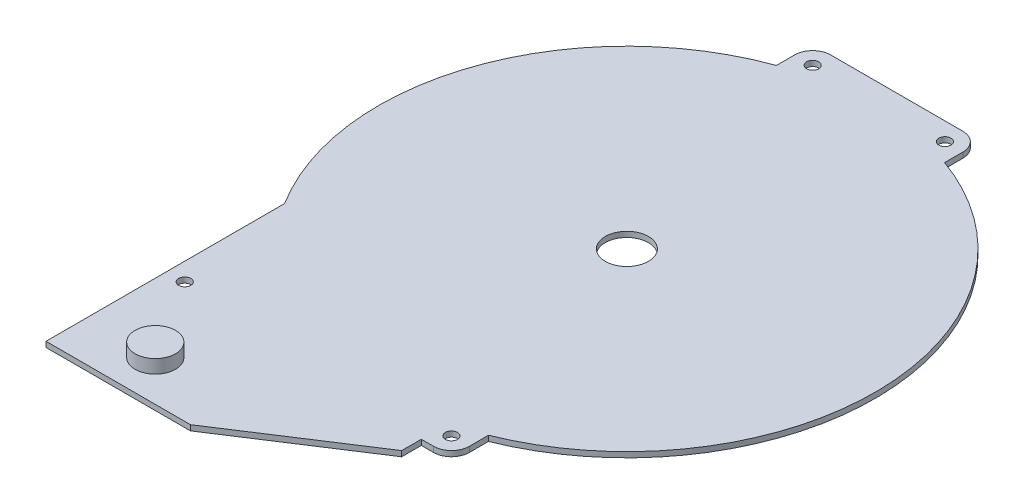
ISO-10303-21;
HEADER;
FILE_DESCRIPTION(('STEP AP214'),'2;1');
FILE_NAME('part.step','',(''),(''),'','','');
FILE_SCHEMA(('AUTOMOTIVE_DESIGN { 1 0 10303 214 1 1 1 1 }'));
ENDSEC;
DATA;
#1=APPLICATION_CONTEXT('core data for automotive mechanical design processes');
#2=APPLICATION_PROTOCOL_DEFINITION('international standard','automotive_design',2000,#1);
#3=PRODUCT_CONTEXT('',#1,'mechanical');
#4=PRODUCT('Part','Part','',(#3));
#5=PRODUCT_RELATED_PRODUCT_CATEGORY('part','',(#4));
#6=PRODUCT_DEFINITION_FORMATION('','',#4);
#7=PRODUCT_DEFINITION_CONTEXT('part definition',#1,'design');
#8=PRODUCT_DEFINITION('design','',#6,#7);
#9=PRODUCT_DEFINITION_SHAPE('','',#8);
#10=(LENGTH_UNIT() NAMED_UNIT(*) SI_UNIT(.MILLI.,.METRE.));
#11=(NAMED_UNIT(*) PLANE_ANGLE_UNIT() SI_UNIT($,.RADIAN.));
#12=(NAMED_UNIT(*) SI_UNIT($,.STERADIAN.) SOLID_ANGLE_UNIT());
#13=UNCERTAINTY_MEASURE_WITH_UNIT(LENGTH_MEASURE(1.E-05),#10,'distance_accuracy_value','');
#14=(GEOMETRIC_REPRESENTATION_CONTEXT(3) GLOBAL_UNCERTAINTY_ASSIGNED_CONTEXT((#13)) GLOBAL_UNIT_ASSIGNED_CONTEXT((#10,
#11,#12)) REPRESENTATION_CONTEXT('',''));
#15=CARTESIAN_POINT('',(0.,0.,0.));
#16=DIRECTION('',(0.,0.,1.));
#17=DIRECTION('',(1.,0.,0.));
#18=AXIS2_PLACEMENT_3D('',#15,#16,#17);
#19=CARTESIAN_POINT('',(0.,-13.5,0.));
#20=DIRECTION('',(0.,-1.,0.));
#21=DIRECTION('',(1.,0.,0.));
#22=AXIS2_PLACEMENT_3D('',#19,#20,#21);
#23=CYLINDRICAL_SURFACE('',#22,92.);
#24=CARTESIAN_POINT('',(0.,-15.5,0.));
#25=DIRECTION('',(0.,-1.,0.));
#26=DIRECTION('',(1.,0.,0.));
#27=AXIS2_PLACEMENT_3D('',#24,#25,#26);
#28=CIRCLE('',#27,92.);
#29=CARTESIAN_POINT('',(31.1619048833757,-15.5,-86.5617449225664));
#30=VERTEX_POINT('',#29);
#31=CARTESIAN_POINT('',(34.15,-15.5,85.4270302656015));
#32=VERTEX_POINT('',#31);
#33=EDGE_CURVE('E170',#30,#32,#28,.T.);
#34=ORIENTED_EDGE('',*,*,#33,.F.);
#35=DIRECTION('',(0.,-1.,0.));
#36=VECTOR('',#35,1.);
#37=CARTESIAN_POINT('',(31.1619048833757,-13.5,-86.5617449225664));
#38=LINE('',#37,#36);
#39=CARTESIAN_POINT('',(31.1619048833757,-13.5,-86.5617449225664));
#40=VERTEX_POINT('',#39);
#41=EDGE_CURVE('E44',#40,#30,#38,.T.);
#42=ORIENTED_EDGE('',*,*,#41,.F.);
#43=CARTESIAN_POINT('',(0.,-13.5,0.));
#44=DIRECTION('',(0.,-1.,0.));
#45=DIRECTION('',(1.,0.,0.));
#46=AXIS2_PLACEMENT_3D('',#43,#44,#45);
#47=CIRCLE('',#46,92.);
#48=CARTESIAN_POINT('',(34.15,-13.5,85.4270302656015));
#49=VERTEX_POINT('',#48);
#50=EDGE_CURVE('E210',#40,#49,#47,.T.);
#51=ORIENTED_EDGE('',*,*,#50,.T.);
#52=DIRECTION('',(0.,-1.,0.));
#53=VECTOR('',#52,1.);
#54=CARTESIAN_POINT('',(34.15,-13.5,85.4270302656015));
#55=LINE('',#54,#53);
#56=EDGE_CURVE('E110',#49,#32,#55,.T.);
#57=ORIENTED_EDGE('',*,*,#56,.T.);
#58=EDGE_LOOP('',(#34,#42,#51,#57));
#59=FACE_BOUND('',#58,.T.);
#60=ADVANCED_FACE('F35',(#59),#23,.T.);
#61=CARTESIAN_POINT('',(31.1619048833757,-13.5,-93.3380951166243));
#62=DIRECTION('',(1.,0.,0.));
#63=DIRECTION('',(0.,1.,0.));
#64=AXIS2_PLACEMENT_3D('',#61,#62,#63);
#65=PLANE('',#64);
#66=DIRECTION('',(0.,0.,1.));
#67=VECTOR('',#66,1.);
#68=CARTESIAN_POINT('',(31.1619048833757,-15.5,-93.3380951166243));
#69=LINE('',#68,#67);
#70=CARTESIAN_POINT('',(31.1619048833757,-15.5,-93.3380951166243));
#71=VERTEX_POINT('',#70);
#72=EDGE_CURVE('E207',#71,#30,#69,.T.);
#73=ORIENTED_EDGE('',*,*,#72,.F.);
#74=DIRECTION('',(0.,-1.,0.));
#75=VECTOR('',#74,1.);
#76=CARTESIAN_POINT('',(31.1619048833757,-13.5,-93.3380951166243));
#77=LINE('',#76,#75);
#78=CARTESIAN_POINT('',(31.1619048833757,-13.5,-93.3380951166243));
#79=VERTEX_POINT('',#78);
#80=EDGE_CURVE('E98',#79,#71,#77,.T.);
#81=ORIENTED_EDGE('',*,*,#80,.F.);
#82=DIRECTION('',(0.,0.,1.));
#83=VECTOR('',#82,1.);
#84=CARTESIAN_POINT('',(31.1619048833757,-13.5,-93.3380951166243));
#85=LINE('',#84,#83);
#86=EDGE_CURVE('E160',#79,#40,#85,.T.);
#87=ORIENTED_EDGE('',*,*,#86,.T.);
#88=ORIENTED_EDGE('',*,*,#41,.T.);
#89=EDGE_LOOP('',(#73,#81,#87,#88));
#90=FACE_BOUND('',#89,.T.);
#91=ADVANCED_FACE('F236',(#90),#65,.T.);
#92=CARTESIAN_POINT('',(24.5,-13.5,-93.3380951166243));
#93=DIRECTION('',(0.,-1.,0.));
#94=DIRECTION('',(1.,0.,0.));
#95=AXIS2_PLACEMENT_3D('',#92,#93,#94);
#96=CYLINDRICAL_SURFACE('',#95,6.6619048833757);
#97=CARTESIAN_POINT('',(24.5,-15.5,-93.3380951166243));
#98=DIRECTION('',(0.,-1.,0.));
#99=DIRECTION('',(1.,0.,0.));
#100=AXIS2_PLACEMENT_3D('',#97,#98,#99);
#101=CIRCLE('',#100,6.6619048833757);
#102=CARTESIAN_POINT('',(24.5,-15.5,-100.));
#103=VERTEX_POINT('',#102);
#104=EDGE_CURVE('E147',#103,#71,#101,.T.);
#105=ORIENTED_EDGE('',*,*,#104,.F.);
#106=DIRECTION('',(0.,-1.,0.));
#107=VECTOR('',#106,1.);
#108=CARTESIAN_POINT('',(24.5,-13.5,-100.));
#109=LINE('',#108,#107);
#110=CARTESIAN_POINT('',(24.5,-13.5,-100.));
#111=VERTEX_POINT('',#110);
#112=EDGE_CURVE('E142',#111,#103,#109,.T.);
#113=ORIENTED_EDGE('',*,*,#112,.F.);
#114=CARTESIAN_POINT('',(24.5,-13.5,-93.3380951166243));
#115=DIRECTION('',(0.,-1.,0.));
#116=DIRECTION('',(1.,0.,0.));
#117=AXIS2_PLACEMENT_3D('',#114,#115,#116);
#118=CIRCLE('',#117,6.6619048833757);
#119=EDGE_CURVE('E145',#111,#79,#118,.T.);
#120=ORIENTED_EDGE('',*,*,#119,.T.);
#121=ORIENTED_EDGE('',*,*,#80,.T.);
#122=EDGE_LOOP('',(#105,#113,#120,#121));
#123=FACE_BOUND('',#122,.T.);
#124=ADVANCED_FACE('F144',(#123),#96,.T.);
#125=CARTESIAN_POINT('',(-24.5,-13.5,-100.));
#126=DIRECTION('',(0.,0.,-1.));
#127=DIRECTION('',(-1.,0.,0.));
#128=AXIS2_PLACEMENT_3D('',#125,#126,#127);
#129=PLANE('',#128);
#130=DIRECTION('',(1.,0.,0.));
#131=VECTOR('',#130,1.);
#132=CARTESIAN_POINT('',(-24.5,-15.5,-100.));
#133=LINE('',#132,#131);
#134=CARTESIAN_POINT('',(-24.5,-15.5,-100.));
#135=VERTEX_POINT('',#134);
#136=EDGE_CURVE('E204',#135,#103,#133,.T.);
#137=ORIENTED_EDGE('',*,*,#136,.F.);
#138=DIRECTION('',(0.,-1.,0.));
#139=VECTOR('',#138,1.);
#140=CARTESIAN_POINT('',(-24.5,-13.5,-100.));
#141=LINE('',#140,#139);
#142=CARTESIAN_POINT('',(-24.5,-13.5,-100.));
#143=VERTEX_POINT('',#142);
#144=EDGE_CURVE('E152',#143,#135,#141,.T.);
#145=ORIENTED_EDGE('',*,*,#144,.F.);
#146=DIRECTION('',(1.,0.,0.));
#147=VECTOR('',#146,1.);
#148=CARTESIAN_POINT('',(-24.5,-13.5,-100.));
#149=LINE('',#148,#147);
#150=EDGE_CURVE('E158',#143,#111,#149,.T.);
#151=ORIENTED_EDGE('',*,*,#150,.T.);
#152=ORIENTED_EDGE('',*,*,#112,.T.);
#153=EDGE_LOOP('',(#137,#145,#151,#152));
#154=FACE_BOUND('',#153,.T.);
#155=ADVANCED_FACE('F162',(#154),#129,.T.);
#156=CARTESIAN_POINT('',(-24.5,-13.5,-93.3380951166243));
#157=DIRECTION('',(0.,-1.,0.));
#158=DIRECTION('',(1.,0.,0.));
#159=AXIS2_PLACEMENT_3D('',#156,#157,#158);
#160=CYLINDRICAL_SURFACE('',#159,6.6619048833757);
#161=CARTESIAN_POINT('',(-24.5,-15.5,-93.3380951166243));
#162=DIRECTION('',(0.,-1.,0.));
#163=DIRECTION('',(1.,0.,0.));
#164=AXIS2_PLACEMENT_3D('',#161,#162,#163);
#165=CIRCLE('',#164,6.6619048833757);
#166=CARTESIAN_POINT('',(-31.1619048833757,-15.5,-93.3380951166243));
#167=VERTEX_POINT('',#166);
#168=EDGE_CURVE('E201',#167,#135,#165,.T.);
#169=ORIENTED_EDGE('',*,*,#168,.F.);
#170=DIRECTION('',(0.,-1.,0.));
#171=VECTOR('',#170,1.);
#172=CARTESIAN_POINT('',(-31.1619048833757,-13.5,-93.3380951166243));
#173=LINE('',#172,#171);
#174=CARTESIAN_POINT('',(-31.1619048833757,-13.5,-93.3380951166243));
#175=VERTEX_POINT('',#174);
#176=EDGE_CURVE('E214',#175,#167,#173,.T.);
#177=ORIENTED_EDGE('',*,*,#176,.F.);
#178=CARTESIAN_POINT('',(-24.5,-13.5,-93.3380951166243));
#179=DIRECTION('',(0.,-1.,0.));
#180=DIRECTION('',(1.,0.,0.));
#181=AXIS2_PLACEMENT_3D('',#178,#179,#180);
#182=CIRCLE('',#181,6.6619048833757);
#183=EDGE_CURVE('E163',#175,#143,#182,.T.);
#184=ORIENTED_EDGE('',*,*,#183,.T.);
#185=ORIENTED_EDGE('',*,*,#144,.T.);
#186=EDGE_LOOP('',(#169,#177,#184,#185));
#187=FACE_BOUND('',#186,.T.);
#188=ADVANCED_FACE('F249',(#187),#160,.T.);
#189=CARTESIAN_POINT('',(-31.1619048833757,-13.5,-86.5617449225664));
#190=DIRECTION('',(-1.,0.,0.));
#191=DIRECTION('',(0.,0.,1.));
#192=AXIS2_PLACEMENT_3D('',#189,#190,#191);
#193=PLANE('',#192);
#194=DIRECTION('',(0.,0.,-1.));
#195=VECTOR('',#194,1.);
#196=CARTESIAN_POINT('',(-31.1619048833757,-15.5,-86.5617449225664));
#197=LINE('',#196,#195);
#198=CARTESIAN_POINT('',(-31.1619048833757,-15.5,-86.5617449225664));
#199=VERTEX_POINT('',#198);
#200=EDGE_CURVE('E198',#199,#167,#197,.T.);
#201=ORIENTED_EDGE('',*,*,#200,.F.);
#202=DIRECTION('',(0.,-1.,0.));
#203=VECTOR('',#202,1.);
#204=CARTESIAN_POINT('',(-31.1619048833757,-13.5,-86.5617449225664));
#205=LINE('',#204,#203);
#206=CARTESIAN_POINT('',(-31.1619048833757,-13.5,-86.5617449225664));
#207=VERTEX_POINT('',#206);
#208=EDGE_CURVE('E216',#207,#199,#205,.T.);
#209=ORIENTED_EDGE('',*,*,#208,.F.);
#210=DIRECTION('',(0.,0.,-1.));
#211=VECTOR('',#210,1.);
#212=CARTESIAN_POINT('',(-31.1619048833757,-13.5,-86.5617449225664));
#213=LINE('',#212,#211);
#214=EDGE_CURVE('E165',#207,#175,#213,.T.);
#215=ORIENTED_EDGE('',*,*,#214,.T.);
#216=ORIENTED_EDGE('',*,*,#176,.T.);
#217=EDGE_LOOP('',(#201,#209,#215,#216));
#218=FACE_BOUND('',#217,.T.);
#219=ADVANCED_FACE('F252',(#218),#193,.T.);
#220=CARTESIAN_POINT('',(0.,-13.5,0.));
#221=DIRECTION('',(0.,-1.,0.));
#222=DIRECTION('',(1.,0.,0.));
#223=AXIS2_PLACEMENT_3D('',#220,#221,#222);
#224=CYLINDRICAL_SURFACE('',#223,92.);
#225=CARTESIAN_POINT('',(0.,-15.5,0.));
#226=DIRECTION('',(0.,-1.,0.));
#227=DIRECTION('',(1.,0.,0.));
#228=AXIS2_PLACEMENT_3D('',#225,#226,#227);
#229=CIRCLE('',#228,92.);
#230=CARTESIAN_POINT('',(-77.9665998412951,-15.5,48.8386047014794));
#231=VERTEX_POINT('',#230);
#232=EDGE_CURVE('E195',#231,#199,#229,.T.);
#233=ORIENTED_EDGE('',*,*,#232,.F.);
#234=DIRECTION('',(0.,-1.,0.));
#235=VECTOR('',#234,1.);
#236=CARTESIAN_POINT('',(-77.9665998412951,-13.5,48.8386047014794));
#237=LINE('',#236,#235);
#238=CARTESIAN_POINT('',(-77.9665998412951,-13.5,48.8386047014794));
#239=VERTEX_POINT('',#238);
#240=EDGE_CURVE('E218',#239,#231,#237,.T.);
#241=ORIENTED_EDGE('',*,*,#240,.F.);
#242=CARTESIAN_POINT('',(0.,-13.5,0.));
#243=DIRECTION('',(0.,-1.,0.));
#244=DIRECTION('',(1.,0.,0.));
#245=AXIS2_PLACEMENT_3D('',#242,#243,#244);
#246=CIRCLE('',#245,92.);
#247=EDGE_CURVE('E379',#239,#207,#246,.T.);
#248=ORIENTED_EDGE('',*,*,#247,.T.);
#249=ORIENTED_EDGE('',*,*,#208,.T.);
#250=EDGE_LOOP('',(#233,#241,#248,#249));
#251=FACE_BOUND('',#250,.T.);
#252=ADVANCED_FACE('F256',(#251),#224,.T.);
#253=CARTESIAN_POINT('',(-77.9665998412951,-13.5,137.248466625773));
#254=DIRECTION('',(-1.,0.,0.));
#255=DIRECTION('',(0.,0.,1.));
#256=AXIS2_PLACEMENT_3D('',#253,#254,#255);
#257=PLANE('',#256);
#258=DIRECTION('',(0.,0.,-1.));
#259=VECTOR('',#258,1.);
#260=CARTESIAN_POINT('',(-77.9665998412951,-15.5,137.248466625773));
#261=LINE('',#260,#259);
#262=CARTESIAN_POINT('',(-77.9665998412951,-15.5,137.248466625773));
#263=VERTEX_POINT('',#262);
#264=EDGE_CURVE('E192',#263,#231,#261,.T.);
#265=ORIENTED_EDGE('',*,*,#264,.F.);
#266=DIRECTION('',(0.,-1.,0.));
#267=VECTOR('',#266,1.);
#268=CARTESIAN_POINT('',(-77.9665998412951,-13.5,137.248466625773));
#269=LINE('',#268,#267);
#270=CARTESIAN_POINT('',(-77.9665998412951,-13.5,137.248466625773));
#271=VERTEX_POINT('',#270);
#272=EDGE_CURVE('E220',#271,#263,#269,.T.);
#273=ORIENTED_EDGE('',*,*,#272,.F.);
#274=DIRECTION('',(0.,0.,-1.));
#275=VECTOR('',#274,1.);
#276=CARTESIAN_POINT('',(-77.9665998412951,-13.5,137.248466625773));
#277=LINE('',#276,#275);
#278=EDGE_CURVE('E376',#271,#239,#277,.T.);
#279=ORIENTED_EDGE('',*,*,#278,.T.);
#280=ORIENTED_EDGE('',*,*,#240,.T.);
#281=EDGE_LOOP('',(#265,#273,#279,#280));
#282=FACE_BOUND('',#281,.T.);
#283=ADVANCED_FACE('F260',(#282),#257,.T.);
#284=CARTESIAN_POINT('',(-24.4583644649651,-13.5,137.248466625773));
#285=DIRECTION('',(0.,0.,1.));
#286=DIRECTION('',(1.,0.,0.));
#287=AXIS2_PLACEMENT_3D('',#284,#285,#286);
#288=PLANE('',#287);
#289=DIRECTION('',(-1.,0.,0.));
#290=VECTOR('',#289,1.);
#291=CARTESIAN_POINT('',(-24.4583644649651,-15.5,137.248466625773));
#292=LINE('',#291,#290);
#293=CARTESIAN_POINT('',(-24.4583644649651,-15.5,137.248466625773));
#294=VERTEX_POINT('',#293);
#295=EDGE_CURVE('E189',#294,#263,#292,.T.);
#296=ORIENTED_EDGE('',*,*,#295,.F.);
#297=DIRECTION('',(0.,-1.,0.));
#298=VECTOR('',#297,1.);
#299=CARTESIAN_POINT('',(-24.4583644649651,-13.5,137.248466625773));
#300=LINE('',#299,#298);
#301=CARTESIAN_POINT('',(-24.4583644649651,-13.5,137.248466625773));
#302=VERTEX_POINT('',#301);
#303=EDGE_CURVE('E222',#302,#294,#300,.T.);
#304=ORIENTED_EDGE('',*,*,#303,.F.);
#305=DIRECTION('',(-1.,0.,0.));
#306=VECTOR('',#305,1.);
#307=CARTESIAN_POINT('',(-24.4583644649651,-13.5,137.248466625773));
#308=LINE('',#307,#306);
#309=EDGE_CURVE('E373',#302,#271,#308,.T.);
#310=ORIENTED_EDGE('',*,*,#309,.T.);
#311=ORIENTED_EDGE('',*,*,#272,.T.);
#312=EDGE_LOOP('',(#296,#304,#310,#311));
#313=FACE_BOUND('',#312,.T.);
#314=ADVANCED_FACE('F264',(#313),#288,.T.);
#315=CARTESIAN_POINT('',(23.,-13.5,106.42864438149));
#316=DIRECTION('',(0.544639035015023,0.,0.838670567945427));
#317=DIRECTION('',(0.838670567945427,0.,-0.544639035015023));
#318=AXIS2_PLACEMENT_3D('',#315,#316,#317);
#319=PLANE('',#318);
#320=DIRECTION('',(-0.838670567945427,0.,0.544639035015023));
#321=VECTOR('',#320,1.);
#322=CARTESIAN_POINT('',(23.,-15.5,106.42864438149));
#323=LINE('',#322,#321);
#324=CARTESIAN_POINT('',(23.,-15.5,106.42864438149));
#325=VERTEX_POINT('',#324);
#326=EDGE_CURVE('E186',#325,#294,#323,.T.);
#327=ORIENTED_EDGE('',*,*,#326,.F.);
#328=DIRECTION('',(0.,-1.,0.));
#329=VECTOR('',#328,1.);
#330=CARTESIAN_POINT('',(23.,-13.5,106.42864438149));
#331=LINE('',#330,#329);
#332=CARTESIAN_POINT('',(23.,-13.5,106.42864438149));
#333=VERTEX_POINT('',#332);
#334=EDGE_CURVE('E224',#333,#325,#331,.T.);
#335=ORIENTED_EDGE('',*,*,#334,.F.);
#336=DIRECTION('',(-0.838670567945427,0.,0.544639035015023));
#337=VECTOR('',#336,1.);
#338=CARTESIAN_POINT('',(23.,-13.5,106.42864438149));
#339=LINE('',#338,#337);
#340=EDGE_CURVE('E370',#333,#302,#339,.T.);
#341=ORIENTED_EDGE('',*,*,#340,.T.);
#342=ORIENTED_EDGE('',*,*,#303,.T.);
#343=EDGE_LOOP('',(#327,#335,#341,#342));
#344=FACE_BOUND('',#343,.T.);
#345=ADVANCED_FACE('F268',(#344),#319,.T.);
#346=CARTESIAN_POINT('',(23.,-13.5,99.1486486387774));
#347=DIRECTION('',(1.,0.,0.));
#348=DIRECTION('',(0.,0.,-1.));
#349=AXIS2_PLACEMENT_3D('',#346,#347,#348);
#350=PLANE('',#349);
#351=DIRECTION('',(0.,0.,1.));
#352=VECTOR('',#351,1.);
#353=CARTESIAN_POINT('',(23.,-15.5,99.1486486387774));
#354=LINE('',#353,#352);
#355=CARTESIAN_POINT('',(23.,-15.5,99.1486486387774));
#356=VERTEX_POINT('',#355);
#357=EDGE_CURVE('E183',#356,#325,#354,.T.);
#358=ORIENTED_EDGE('',*,*,#357,.F.);
#359=DIRECTION('',(0.,-1.,0.));
#360=VECTOR('',#359,1.);
#361=CARTESIAN_POINT('',(23.,-13.5,99.1486486387774));
#362=LINE('',#361,#360);
#363=CARTESIAN_POINT('',(23.,-13.5,99.1486486387774));
#364=VERTEX_POINT('',#363);
#365=EDGE_CURVE('E226',#364,#356,#362,.T.);
#366=ORIENTED_EDGE('',*,*,#365,.F.);
#367=DIRECTION('',(0.,0.,1.));
#368=VECTOR('',#367,1.);
#369=CARTESIAN_POINT('',(23.,-13.5,99.1486486387774));
#370=LINE('',#369,#368);
#371=EDGE_CURVE('E367',#364,#333,#370,.T.);
#372=ORIENTED_EDGE('',*,*,#371,.T.);
#373=ORIENTED_EDGE('',*,*,#334,.T.);
#374=EDGE_LOOP('',(#358,#366,#372,#373));
#375=FACE_BOUND('',#374,.T.);
#376=ADVANCED_FACE('F272',(#375),#350,.T.);
#377=CARTESIAN_POINT('',(27.5,-13.5,99.1486486387774));
#378=DIRECTION('',(0.,0.,1.));
#379=DIRECTION('',(1.,0.,0.));
#380=AXIS2_PLACEMENT_3D('',#377,#378,#379);
#381=PLANE('',#380);
#382=DIRECTION('',(-1.,0.,0.));
#383=VECTOR('',#382,1.);
#384=CARTESIAN_POINT('',(27.5,-15.5,99.1486486387774));
#385=LINE('',#384,#383);
#386=CARTESIAN_POINT('',(27.5,-15.5,99.1486486387774));
#387=VERTEX_POINT('',#386);
#388=EDGE_CURVE('E180',#387,#356,#385,.T.);
#389=ORIENTED_EDGE('',*,*,#388,.F.);
#390=DIRECTION('',(0.,-1.,0.));
#391=VECTOR('',#390,1.);
#392=CARTESIAN_POINT('',(27.5,-13.5,99.1486486387774));
#393=LINE('',#392,#391);
#394=CARTESIAN_POINT('',(27.5,-13.5,99.1486486387774));
#395=VERTEX_POINT('',#394);
#396=EDGE_CURVE('E228',#395,#387,#393,.T.);
#397=ORIENTED_EDGE('',*,*,#396,.F.);
#398=DIRECTION('',(-1.,0.,0.));
#399=VECTOR('',#398,1.);
#400=CARTESIAN_POINT('',(27.5,-13.5,99.1486486387774));
#401=LINE('',#400,#399);
#402=EDGE_CURVE('E364',#395,#364,#401,.T.);
#403=ORIENTED_EDGE('',*,*,#402,.T.);
#404=ORIENTED_EDGE('',*,*,#365,.T.);
#405=EDGE_LOOP('',(#389,#397,#403,#404));
#406=FACE_BOUND('',#405,.T.);
#407=ADVANCED_FACE('F276',(#406),#381,.T.);
#408=CARTESIAN_POINT('',(27.5,-13.5,92.4986486387774));
#409=DIRECTION('',(0.,-1.,0.));
#410=DIRECTION('',(1.,0.,0.));
#411=AXIS2_PLACEMENT_3D('',#408,#409,#410);
#412=CYLINDRICAL_SURFACE('',#411,6.65);
#413=CARTESIAN_POINT('',(27.5,-15.5,92.4986486387774));
#414=DIRECTION('',(0.,-1.,0.));
#415=DIRECTION('',(1.,0.,0.));
#416=AXIS2_PLACEMENT_3D('',#413,#414,#415);
#417=CIRCLE('',#416,6.65);
#418=CARTESIAN_POINT('',(34.15,-15.5,92.4986486387774));
#419=VERTEX_POINT('',#418);
#420=EDGE_CURVE('E177',#419,#387,#417,.T.);
#421=ORIENTED_EDGE('',*,*,#420,.F.);
#422=DIRECTION('',(0.,-1.,0.));
#423=VECTOR('',#422,1.);
#424=CARTESIAN_POINT('',(34.15,-13.5,92.4986486387774));
#425=LINE('',#424,#423);
#426=CARTESIAN_POINT('',(34.15,-13.5,92.4986486387774));
#427=VERTEX_POINT('',#426);
#428=EDGE_CURVE('E230',#427,#419,#425,.T.);
#429=ORIENTED_EDGE('',*,*,#428,.F.);
#430=CARTESIAN_POINT('',(27.5,-13.5,92.4986486387774));
#431=DIRECTION('',(0.,-1.,0.));
#432=DIRECTION('',(1.,0.,0.));
#433=AXIS2_PLACEMENT_3D('',#430,#431,#432);
#434=CIRCLE('',#433,6.65);
#435=EDGE_CURVE('E361',#427,#395,#434,.T.);
#436=ORIENTED_EDGE('',*,*,#435,.T.);
#437=ORIENTED_EDGE('',*,*,#396,.T.);
#438=EDGE_LOOP('',(#421,#429,#436,#437));
#439=FACE_BOUND('',#438,.T.);
#440=ADVANCED_FACE('F280',(#439),#412,.T.);
#441=CARTESIAN_POINT('',(34.15,-13.5,85.4270302656015));
#442=DIRECTION('',(1.,0.,0.));
#443=DIRECTION('',(0.,0.,-1.));
#444=AXIS2_PLACEMENT_3D('',#441,#442,#443);
#445=PLANE('',#444);
#446=DIRECTION('',(0.,0.,1.));
#447=VECTOR('',#446,1.);
#448=CARTESIAN_POINT('',(34.15,-15.5,85.4270302656015));
#449=LINE('',#448,#447);
#450=EDGE_CURVE('E173',#32,#419,#449,.T.);
#451=ORIENTED_EDGE('',*,*,#450,.F.);
#452=ORIENTED_EDGE('',*,*,#56,.F.);
#453=DIRECTION('',(0.,0.,1.));
#454=VECTOR('',#453,1.);
#455=CARTESIAN_POINT('',(34.15,-13.5,85.4270302656015));
#456=LINE('',#455,#454);
#457=EDGE_CURVE('E359',#49,#427,#456,.T.);
#458=ORIENTED_EDGE('',*,*,#457,.T.);
#459=ORIENTED_EDGE('',*,*,#428,.T.);
#460=EDGE_LOOP('',(#451,#452,#458,#459));
#461=FACE_BOUND('',#460,.T.);
#462=ADVANCED_FACE('F232',(#461),#445,.T.);
#463=CARTESIAN_POINT('',(0.,-13.5,0.));
#464=DIRECTION('',(0.,-1.,0.));
#465=DIRECTION('',(1.,0.,0.));
#466=AXIS2_PLACEMENT_3D('',#463,#464,#465);
#467=PLANE('',#466);
#468=CARTESIAN_POINT('',(0.,-13.5,0.));
#469=DIRECTION('',(0.,1.,0.));
#470=DIRECTION('',(-1.,0.,0.));
#471=AXIS2_PLACEMENT_3D('',#468,#469,#470);
#472=CIRCLE('',#471,8.);
#473=CARTESIAN_POINT('',(-8.,-13.5,0.));
#474=VERTEX_POINT('',#473);
#475=EDGE_CURVE('E329',#474,#474,#472,.T.);
#476=ORIENTED_EDGE('',*,*,#475,.F.);
#477=EDGE_LOOP('',(#476));
#478=FACE_BOUND('',#477,.T.);
#479=CARTESIAN_POINT('',(-52.4665998412951,-13.5,122.248466625773));
#480=DIRECTION('',(0.,-1.,0.));
#481=DIRECTION('',(1.,0.,0.));
#482=AXIS2_PLACEMENT_3D('',#479,#480,#481);
#483=CIRCLE('',#482,7.5);
#484=CARTESIAN_POINT('',(-44.9665998412951,-13.5,122.248466625773));
#485=VERTEX_POINT('',#484);
#486=EDGE_CURVE('E11',#485,#485,#483,.F.);
#487=ORIENTED_EDGE('',*,*,#486,.F.);
#488=EDGE_LOOP('',(#487));
#489=FACE_BOUND('',#488,.T.);
#490=CARTESIAN_POINT('',(-71.3165998412951,-13.5,92.4986486387774));
#491=DIRECTION('',(0.,-1.,0.));
#492=DIRECTION('',(1.,0.,0.));
#493=AXIS2_PLACEMENT_3D('',#490,#491,#492);
#494=CIRCLE('',#493,2.25);
#495=CARTESIAN_POINT('',(-69.0665998412951,-13.5,92.4986486387774));
#496=VERTEX_POINT('',#495);
#497=EDGE_CURVE('E336',#496,#496,#494,.T.);
#498=ORIENTED_EDGE('',*,*,#497,.T.);
#499=EDGE_LOOP('',(#498));
#500=FACE_BOUND('',#499,.T.);
#501=CARTESIAN_POINT('',(27.5,-13.5,92.4986486387774));
#502=DIRECTION('',(0.,-1.,0.));
#503=DIRECTION('',(1.,0.,0.));
#504=AXIS2_PLACEMENT_3D('',#501,#502,#503);
#505=CIRCLE('',#504,2.24999999999999);
#506=CARTESIAN_POINT('',(29.75,-13.5,92.4986486387774));
#507=VERTEX_POINT('',#506);
#508=EDGE_CURVE('E342',#507,#507,#505,.T.);
#509=ORIENTED_EDGE('',*,*,#508,.T.);
#510=EDGE_LOOP('',(#509));
#511=FACE_BOUND('',#510,.T.);
#512=CARTESIAN_POINT('',(-24.5,-13.5,-93.3380951166243));
#513=DIRECTION('',(0.,-1.,0.));
#514=DIRECTION('',(1.,0.,0.));
#515=AXIS2_PLACEMENT_3D('',#512,#513,#514);
#516=CIRCLE('',#515,2.25);
#517=CARTESIAN_POINT('',(-22.25,-13.5,-93.3380951166243));
#518=VERTEX_POINT('',#517);
#519=EDGE_CURVE('E348',#518,#518,#516,.T.);
#520=ORIENTED_EDGE('',*,*,#519,.T.);
#521=EDGE_LOOP('',(#520));
#522=FACE_BOUND('',#521,.T.);
#523=CARTESIAN_POINT('',(24.5,-13.5,-93.3380951166243));
#524=DIRECTION('',(0.,-1.,0.));
#525=DIRECTION('',(1.,0.,0.));
#526=AXIS2_PLACEMENT_3D('',#523,#524,#525);
#527=CIRCLE('',#526,2.25);
#528=CARTESIAN_POINT('',(26.75,-13.5,-93.3380951166243));
#529=VERTEX_POINT('',#528);
#530=EDGE_CURVE('E174',#529,#529,#527,.T.);
#531=ORIENTED_EDGE('',*,*,#530,.T.);
#532=EDGE_LOOP('',(#531));
#533=FACE_BOUND('',#532,.T.);
#534=ORIENTED_EDGE('',*,*,#50,.F.);
#535=ORIENTED_EDGE('',*,*,#86,.F.);
#536=ORIENTED_EDGE('',*,*,#119,.F.);
#537=ORIENTED_EDGE('',*,*,#150,.F.);
#538=ORIENTED_EDGE('',*,*,#183,.F.);
#539=ORIENTED_EDGE('',*,*,#214,.F.);
#540=ORIENTED_EDGE('',*,*,#247,.F.);
#541=ORIENTED_EDGE('',*,*,#278,.F.);
#542=ORIENTED_EDGE('',*,*,#309,.F.);
#543=ORIENTED_EDGE('',*,*,#340,.F.);
#544=ORIENTED_EDGE('',*,*,#371,.F.);
#545=ORIENTED_EDGE('',*,*,#402,.F.);
#546=ORIENTED_EDGE('',*,*,#435,.F.);
#547=ORIENTED_EDGE('',*,*,#457,.F.);
#548=EDGE_LOOP('',(#534,#535,#536,#537,#538,#539,#540,#541,#542,#543,#544,#545,#546,#547));
#549=FACE_BOUND('',#548,.T.);
#550=ADVANCED_FACE('F156',(#478,#489,#500,#511,#522,#533,#549),#467,.F.);
#551=CARTESIAN_POINT('',(0.,-15.5,0.));
#552=DIRECTION('',(0.,-1.,0.));
#553=DIRECTION('',(1.,0.,0.));
#554=AXIS2_PLACEMENT_3D('',#551,#552,#553);
#555=PLANE('',#554);
#556=CARTESIAN_POINT('',(0.,-15.5,0.));
#557=DIRECTION('',(0.,-1.,0.));
#558=DIRECTION('',(1.,0.,0.));
#559=AXIS2_PLACEMENT_3D('',#556,#557,#558);
#560=CIRCLE('',#559,8.);
#561=CARTESIAN_POINT('',(8.,-15.5,0.));
#562=VERTEX_POINT('',#561);
#563=EDGE_CURVE('E38',#562,#562,#560,.T.);
#564=ORIENTED_EDGE('',*,*,#563,.F.);
#565=EDGE_LOOP('',(#564));
#566=FACE_BOUND('',#565,.T.);
#567=CARTESIAN_POINT('',(-71.3165998412951,-15.5,92.4986486387774));
#568=DIRECTION('',(0.,-1.,0.));
#569=DIRECTION('',(1.,0.,0.));
#570=AXIS2_PLACEMENT_3D('',#567,#568,#569);
#571=CIRCLE('',#570,2.25);
#572=CARTESIAN_POINT('',(-69.0665998412951,-15.5,92.4986486387774));
#573=VERTEX_POINT('',#572);
#574=EDGE_CURVE('E335',#573,#573,#571,.T.);
#575=ORIENTED_EDGE('',*,*,#574,.F.);
#576=EDGE_LOOP('',(#575));
#577=FACE_BOUND('',#576,.T.);
#578=CARTESIAN_POINT('',(27.5,-15.5,92.4986486387774));
#579=DIRECTION('',(0.,-1.,0.));
#580=DIRECTION('',(1.,0.,0.));
#581=AXIS2_PLACEMENT_3D('',#578,#579,#580);
#582=CIRCLE('',#581,2.24999999999999);
#583=CARTESIAN_POINT('',(29.75,-15.5,92.4986486387774));
#584=VERTEX_POINT('',#583);
#585=EDGE_CURVE('E339',#584,#584,#582,.T.);
#586=ORIENTED_EDGE('',*,*,#585,.F.);
#587=EDGE_LOOP('',(#586));
#588=FACE_BOUND('',#587,.T.);
#589=CARTESIAN_POINT('',(-24.5,-15.5,-93.3380951166243));
#590=DIRECTION('',(0.,-1.,0.));
#591=DIRECTION('',(1.,0.,0.));
#592=AXIS2_PLACEMENT_3D('',#589,#590,#591);
#593=CIRCLE('',#592,2.25);
#594=CARTESIAN_POINT('',(-22.25,-15.5,-93.3380951166243));
#595=VERTEX_POINT('',#594);
#596=EDGE_CURVE('E345',#595,#595,#593,.T.);
#597=ORIENTED_EDGE('',*,*,#596,.F.);
#598=EDGE_LOOP('',(#597));
#599=FACE_BOUND('',#598,.T.);
#600=CARTESIAN_POINT('',(24.5,-15.5,-93.3380951166243));
#601=DIRECTION('',(0.,-1.,0.));
#602=DIRECTION('',(1.,0.,0.));
#603=AXIS2_PLACEMENT_3D('',#600,#601,#602);
#604=CIRCLE('',#603,2.25);
#605=CARTESIAN_POINT('',(26.75,-15.5,-93.3380951166243));
#606=VERTEX_POINT('',#605);
#607=EDGE_CURVE('E351',#606,#606,#604,.T.);
#608=ORIENTED_EDGE('',*,*,#607,.F.);
#609=EDGE_LOOP('',(#608));
#610=FACE_BOUND('',#609,.T.);
#611=ORIENTED_EDGE('',*,*,#33,.T.);
#612=ORIENTED_EDGE('',*,*,#450,.T.);
#613=ORIENTED_EDGE('',*,*,#420,.T.);
#614=ORIENTED_EDGE('',*,*,#388,.T.);
#615=ORIENTED_EDGE('',*,*,#357,.T.);
#616=ORIENTED_EDGE('',*,*,#326,.T.);
#617=ORIENTED_EDGE('',*,*,#295,.T.);
#618=ORIENTED_EDGE('',*,*,#264,.T.);
#619=ORIENTED_EDGE('',*,*,#232,.T.);
#620=ORIENTED_EDGE('',*,*,#200,.T.);
#621=ORIENTED_EDGE('',*,*,#168,.T.);
#622=ORIENTED_EDGE('',*,*,#136,.T.);
#623=ORIENTED_EDGE('',*,*,#104,.T.);
#624=ORIENTED_EDGE('',*,*,#72,.T.);
#625=EDGE_LOOP('',(#611,#612,#613,#614,#615,#616,#617,#618,#619,#620,#621,#622,#623,#624));
#626=FACE_BOUND('',#625,.T.);
#627=ADVANCED_FACE('F235',(#566,#577,#588,#599,#610,#626),#555,.T.);
#628=CARTESIAN_POINT('',(24.5,-13.5,-93.3380951166243));
#629=DIRECTION('',(0.,-1.,0.));
#630=DIRECTION('',(1.,0.,0.));
#631=AXIS2_PLACEMENT_3D('',#628,#629,#630);
#632=CYLINDRICAL_SURFACE('',#631,2.25);
#633=ORIENTED_EDGE('',*,*,#530,.F.);
#634=EDGE_LOOP('',(#633));
#635=FACE_BOUND('',#634,.T.);
#636=ORIENTED_EDGE('',*,*,#607,.T.);
#637=EDGE_LOOP('',(#636));
#638=FACE_BOUND('',#637,.T.);
#639=ADVANCED_FACE('F292',(#635,#638),#632,.F.);
#640=CARTESIAN_POINT('',(-24.5,-13.5,-93.3380951166243));
#641=DIRECTION('',(0.,-1.,0.));
#642=DIRECTION('',(1.,0.,0.));
#643=AXIS2_PLACEMENT_3D('',#640,#641,#642);
#644=CYLINDRICAL_SURFACE('',#643,2.25);
#645=ORIENTED_EDGE('',*,*,#519,.F.);
#646=EDGE_LOOP('',(#645));
#647=FACE_BOUND('',#646,.T.);
#648=ORIENTED_EDGE('',*,*,#596,.T.);
#649=EDGE_LOOP('',(#648));
#650=FACE_BOUND('',#649,.T.);
#651=ADVANCED_FACE('F299',(#647,#650),#644,.F.);
#652=CARTESIAN_POINT('',(27.5,-13.5,92.4986486387774));
#653=DIRECTION('',(0.,-1.,0.));
#654=DIRECTION('',(1.,0.,0.));
#655=AXIS2_PLACEMENT_3D('',#652,#653,#654);
#656=CYLINDRICAL_SURFACE('',#655,2.24999999999999);
#657=ORIENTED_EDGE('',*,*,#508,.F.);
#658=EDGE_LOOP('',(#657));
#659=FACE_BOUND('',#658,.T.);
#660=ORIENTED_EDGE('',*,*,#585,.T.);
#661=EDGE_LOOP('',(#660));
#662=FACE_BOUND('',#661,.T.);
#663=ADVANCED_FACE('F303',(#659,#662),#656,.F.);
#664=CARTESIAN_POINT('',(-71.3165998412951,-13.5,92.4986486387774));
#665=DIRECTION('',(0.,-1.,0.));
#666=DIRECTION('',(1.,0.,0.));
#667=AXIS2_PLACEMENT_3D('',#664,#665,#666);
#668=CYLINDRICAL_SURFACE('',#667,2.25);
#669=ORIENTED_EDGE('',*,*,#497,.F.);
#670=EDGE_LOOP('',(#669));
#671=FACE_BOUND('',#670,.T.);
#672=ORIENTED_EDGE('',*,*,#574,.T.);
#673=EDGE_LOOP('',(#672));
#674=FACE_BOUND('',#673,.T.);
#675=ADVANCED_FACE('F307',(#671,#674),#668,.F.);
#676=CARTESIAN_POINT('',(-52.4665998412951,-8.50000000000001,122.248466625773));
#677=DIRECTION('',(0.,-1.,0.));
#678=DIRECTION('',(1.,0.,0.));
#679=AXIS2_PLACEMENT_3D('',#676,#677,#678);
#680=CYLINDRICAL_SURFACE('',#679,7.5);
#681=CARTESIAN_POINT('',(-52.4665998412951,-8.50000000000001,122.248466625773));
#682=DIRECTION('',(0.,1.,0.));
#683=DIRECTION('',(-1.,0.,0.));
#684=AXIS2_PLACEMENT_3D('',#681,#682,#683);
#685=CIRCLE('',#684,7.5);
#686=CARTESIAN_POINT('',(-59.9665998412951,-8.50000000000001,122.248466625773));
#687=VERTEX_POINT('',#686);
#688=EDGE_CURVE('E331',#687,#687,#685,.T.);
#689=ORIENTED_EDGE('',*,*,#688,.F.);
#690=EDGE_LOOP('',(#689));
#691=FACE_BOUND('',#690,.T.);
#692=ORIENTED_EDGE('',*,*,#486,.T.);
#693=EDGE_LOOP('',(#692));
#694=FACE_BOUND('',#693,.T.);
#695=ADVANCED_FACE('F311',(#691,#694),#680,.T.);
#696=CARTESIAN_POINT('',(-52.4665998412951,-8.50000000000001,122.248466625773));
#697=DIRECTION('',(0.,1.,0.));
#698=DIRECTION('',(-1.,0.,0.));
#699=AXIS2_PLACEMENT_3D('',#696,#697,#698);
#700=PLANE('',#699);
#701=ORIENTED_EDGE('',*,*,#688,.T.);
#702=EDGE_LOOP('',(#701));
#703=FACE_BOUND('',#702,.T.);
#704=ADVANCED_FACE('F315',(#703),#700,.T.);
#705=CARTESIAN_POINT('',(0.,-23.5,0.));
#706=DIRECTION('',(0.,1.,0.));
#707=DIRECTION('',(-1.,0.,0.));
#708=AXIS2_PLACEMENT_3D('',#705,#706,#707);
#709=CYLINDRICAL_SURFACE('',#708,8.);
#710=ORIENTED_EDGE('',*,*,#563,.T.);
#711=EDGE_LOOP('',(#710));
#712=FACE_BOUND('',#711,.T.);
#713=ORIENTED_EDGE('',*,*,#475,.T.);
#714=EDGE_LOOP('',(#713));
#715=FACE_BOUND('',#714,.T.);
#716=ADVANCED_FACE('F319',(#712,#715),#709,.F.);
#717=CLOSED_SHELL('',(#60,#91,#124,#155,#188,#219,#252,#283,#314,#345,#376,#407,#440,#462,#550,
#627,#639,#651,#663,#675,#695,#704,#716));
#718=MANIFOLD_SOLID_BREP('B2',#717);
#719=ADVANCED_BREP_SHAPE_REPRESENTATION('',(#18,#718),#14);
#720=SHAPE_DEFINITION_REPRESENTATION(#9,#719);
ENDSEC;
END-ISO-10303-21;
